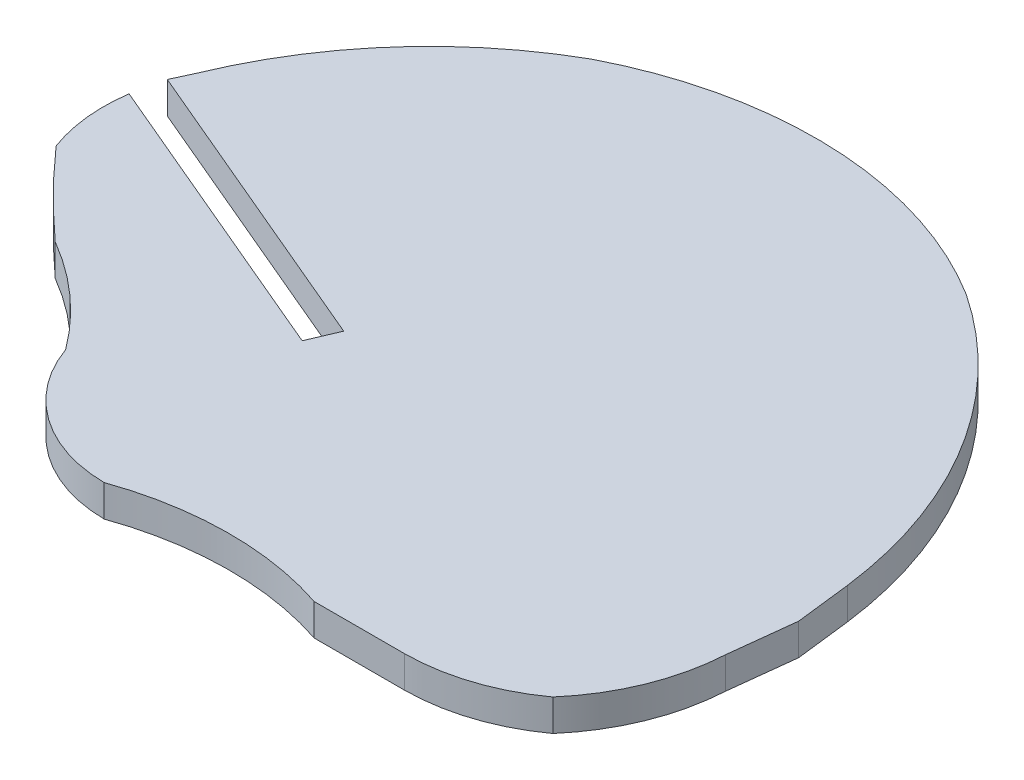
ISO-10303-21;
HEADER;
FILE_DESCRIPTION(('STEP AP214'),'2;1');
FILE_NAME('part.step','',(''),(''),'','','');
FILE_SCHEMA(('AUTOMOTIVE_DESIGN { 1 0 10303 214 1 1 1 1 }'));
ENDSEC;
DATA;
#1=APPLICATION_CONTEXT('core data for automotive mechanical design processes');
#2=APPLICATION_PROTOCOL_DEFINITION('international standard','automotive_design',2000,#1);
#3=PRODUCT_CONTEXT('',#1,'mechanical');
#4=PRODUCT('Part','Part','',(#3));
#5=PRODUCT_RELATED_PRODUCT_CATEGORY('part','',(#4));
#6=PRODUCT_DEFINITION_FORMATION('','',#4);
#7=PRODUCT_DEFINITION_CONTEXT('part definition',#1,'design');
#8=PRODUCT_DEFINITION('design','',#6,#7);
#9=PRODUCT_DEFINITION_SHAPE('','',#8);
#10=(LENGTH_UNIT() NAMED_UNIT(*) SI_UNIT(.MILLI.,.METRE.));
#11=(NAMED_UNIT(*) PLANE_ANGLE_UNIT() SI_UNIT($,.RADIAN.));
#12=(NAMED_UNIT(*) SI_UNIT($,.STERADIAN.) SOLID_ANGLE_UNIT());
#13=UNCERTAINTY_MEASURE_WITH_UNIT(LENGTH_MEASURE(1.E-05),#10,'distance_accuracy_value','');
#14=(GEOMETRIC_REPRESENTATION_CONTEXT(3) GLOBAL_UNCERTAINTY_ASSIGNED_CONTEXT((#13)) GLOBAL_UNIT_ASSIGNED_CONTEXT((#10,
#11,#12)) REPRESENTATION_CONTEXT('',''));
#15=CARTESIAN_POINT('',(0.,0.,0.));
#16=DIRECTION('',(0.,0.,1.));
#17=DIRECTION('',(1.,0.,0.));
#18=AXIS2_PLACEMENT_3D('',#15,#16,#17);
#19=CARTESIAN_POINT('',(-201.178824260618,2.,-595.816390173539));
#20=DIRECTION('',(0.,-1.,0.));
#21=DIRECTION('',(0.,0.,-1.));
#22=AXIS2_PLACEMENT_3D('',#19,#20,#21);
#23=CYLINDRICAL_SURFACE('',#22,25.04878585);
#24=CARTESIAN_POINT('',(-201.178824260618,0.,-595.816390173539));
#25=DIRECTION('',(0.,1.,0.));
#26=DIRECTION('',(0.,0.,1.));
#27=AXIS2_PLACEMENT_3D('',#24,#25,#26);
#28=CIRCLE('',#27,25.04878585);
#29=CARTESIAN_POINT('',(-187.918530000009,0.,-617.067419999908));
#30=VERTEX_POINT('',#29);
#31=CARTESIAN_POINT('',(-212.66633999995,0.,-618.075740000022));
#32=VERTEX_POINT('',#31);
#33=EDGE_CURVE('E11',#30,#32,#28,.T.);
#34=ORIENTED_EDGE('',*,*,#33,.T.);
#35=DIRECTION('',(0.,-1.,0.));
#36=VECTOR('',#35,1.);
#37=CARTESIAN_POINT('',(-212.66633999995,2.,-618.075740000022));
#38=LINE('',#37,#36);
#39=CARTESIAN_POINT('',(-212.66633999995,2.,-618.075740000022));
#40=VERTEX_POINT('',#39);
#41=EDGE_CURVE('E342',#40,#32,#38,.T.);
#42=ORIENTED_EDGE('',*,*,#41,.F.);
#43=CARTESIAN_POINT('',(-201.178824260618,2.,-595.816390173539));
#44=DIRECTION('',(0.,1.,0.));
#45=DIRECTION('',(0.,0.,1.));
#46=AXIS2_PLACEMENT_3D('',#43,#44,#45);
#47=CIRCLE('',#46,25.04878585);
#48=CARTESIAN_POINT('',(-187.918530000009,2.,-617.067419999908));
#49=VERTEX_POINT('',#48);
#50=EDGE_CURVE('E41',#49,#40,#47,.T.);
#51=ORIENTED_EDGE('',*,*,#50,.F.);
#52=DIRECTION('',(0.,-1.,0.));
#53=VECTOR('',#52,1.);
#54=CARTESIAN_POINT('',(-187.918530000009,2.,-617.067419999908));
#55=LINE('',#54,#53);
#56=EDGE_CURVE('E195',#49,#30,#55,.T.);
#57=ORIENTED_EDGE('',*,*,#56,.T.);
#58=EDGE_LOOP('',(#34,#42,#51,#57));
#59=FACE_BOUND('',#58,.T.);
#60=ADVANCED_FACE('F37',(#59),#23,.T.);
#61=CARTESIAN_POINT('',(-199.322342821807,2.,-594.556136802383));
#62=DIRECTION('',(0.,-1.,0.));
#63=DIRECTION('',(0.,0.,-1.));
#64=AXIS2_PLACEMENT_3D('',#61,#62,#63);
#65=CYLINDRICAL_SURFACE('',#64,27.0413386367001);
#66=CARTESIAN_POINT('',(-199.322342821807,0.,-594.556136802383));
#67=DIRECTION('',(0.,1.,0.));
#68=DIRECTION('',(0.,0.,1.));
#69=AXIS2_PLACEMENT_3D('',#66,#67,#68);
#70=CIRCLE('',#69,27.0413386367001);
#71=CARTESIAN_POINT('',(-224.319209999995,0.,-604.870720000006));
#72=VERTEX_POINT('',#71);
#73=EDGE_CURVE('E47',#32,#72,#70,.T.);
#74=ORIENTED_EDGE('',*,*,#73,.T.);
#75=DIRECTION('',(0.,-1.,0.));
#76=VECTOR('',#75,1.);
#77=CARTESIAN_POINT('',(-224.319209999995,2.,-604.870720000006));
#78=LINE('',#77,#76);
#79=CARTESIAN_POINT('',(-224.319209999995,2.,-604.870720000006));
#80=VERTEX_POINT('',#79);
#81=EDGE_CURVE('E171',#80,#72,#78,.T.);
#82=ORIENTED_EDGE('',*,*,#81,.F.);
#83=CARTESIAN_POINT('',(-199.322342821807,2.,-594.556136802383));
#84=DIRECTION('',(0.,1.,0.));
#85=DIRECTION('',(0.,0.,1.));
#86=AXIS2_PLACEMENT_3D('',#83,#84,#85);
#87=CIRCLE('',#86,27.0413386367001);
#88=EDGE_CURVE('E110',#40,#80,#87,.T.);
#89=ORIENTED_EDGE('',*,*,#88,.F.);
#90=ORIENTED_EDGE('',*,*,#41,.T.);
#91=EDGE_LOOP('',(#74,#82,#89,#90));
#92=FACE_BOUND('',#91,.T.);
#93=ADVANCED_FACE('F343',(#92),#65,.T.);
#94=CARTESIAN_POINT('',(-289.527334703317,2.,-463.291078429003));
#95=DIRECTION('',(0.908291866319763,0.,0.418337047818337));
#96=DIRECTION('',(0.418337047818337,0.,-0.908291866319763));
#97=AXIS2_PLACEMENT_3D('',#94,#95,#96);
#98=PLANE('',#97);
#99=DIRECTION('',(-0.418337047818337,0.,0.908291866319763));
#100=VECTOR('',#99,1.);
#101=CARTESIAN_POINT('',(-289.527334703317,0.,-463.291078429003));
#102=LINE('',#101,#100);
#103=CARTESIAN_POINT('',(-224.91344,0.,-603.58053));
#104=VERTEX_POINT('',#103);
#105=EDGE_CURVE('E165',#72,#104,#102,.T.);
#106=ORIENTED_EDGE('',*,*,#105,.T.);
#107=DIRECTION('',(0.,-1.,0.));
#108=VECTOR('',#107,1.);
#109=CARTESIAN_POINT('',(-224.91344,2.,-603.58053));
#110=LINE('',#109,#108);
#111=CARTESIAN_POINT('',(-224.91344,2.,-603.58053));
#112=VERTEX_POINT('',#111);
#113=EDGE_CURVE('E169',#112,#104,#110,.T.);
#114=ORIENTED_EDGE('',*,*,#113,.F.);
#115=DIRECTION('',(-0.418337047818337,0.,0.908291866319763));
#116=VECTOR('',#115,1.);
#117=CARTESIAN_POINT('',(-289.527334703317,2.,-463.291078429003));
#118=LINE('',#117,#116);
#119=EDGE_CURVE('E222',#80,#112,#118,.T.);
#120=ORIENTED_EDGE('',*,*,#119,.F.);
#121=ORIENTED_EDGE('',*,*,#81,.T.);
#122=EDGE_LOOP('',(#106,#114,#120,#121));
#123=FACE_BOUND('',#122,.T.);
#124=ADVANCED_FACE('F167',(#123),#98,.F.);
#125=CARTESIAN_POINT('',(-468.755826670752,2.,-706.916494491902));
#126=DIRECTION('',(0.390190390776438,0.,-0.920734195599213));
#127=DIRECTION('',(-0.920734195599213,0.,-0.390190390776438));
#128=AXIS2_PLACEMENT_3D('',#125,#126,#127);
#129=PLANE('',#128);
#130=DIRECTION('',(0.920734195599213,0.,0.390190390776438));
#131=VECTOR('',#130,1.);
#132=CARTESIAN_POINT('',(-468.755826670752,0.,-706.916494491902));
#133=LINE('',#132,#131);
#134=CARTESIAN_POINT('',(-205.5657,0.,-595.38131));
#135=VERTEX_POINT('',#134);
#136=EDGE_CURVE('E173',#104,#135,#133,.T.);
#137=ORIENTED_EDGE('',*,*,#136,.T.);
#138=DIRECTION('',(0.,-1.,0.));
#139=VECTOR('',#138,1.);
#140=CARTESIAN_POINT('',(-205.5657,2.,-595.38131));
#141=LINE('',#140,#139);
#142=CARTESIAN_POINT('',(-205.5657,2.,-595.38131));
#143=VERTEX_POINT('',#142);
#144=EDGE_CURVE('E180',#143,#135,#141,.T.);
#145=ORIENTED_EDGE('',*,*,#144,.F.);
#146=DIRECTION('',(0.920734195599213,0.,0.390190390776438));
#147=VECTOR('',#146,1.);
#148=CARTESIAN_POINT('',(-468.755826670752,2.,-706.916494491902));
#149=LINE('',#148,#147);
#150=EDGE_CURVE('E179',#112,#143,#149,.T.);
#151=ORIENTED_EDGE('',*,*,#150,.F.);
#152=ORIENTED_EDGE('',*,*,#113,.T.);
#153=EDGE_LOOP('',(#137,#145,#151,#152));
#154=FACE_BOUND('',#153,.T.);
#155=ADVANCED_FACE('F176',(#154),#129,.F.);
#156=CARTESIAN_POINT('',(-263.889536272211,2.,-459.607107482068));
#157=DIRECTION('',(0.918814193131808,0.,0.39469035774838));
#158=DIRECTION('',(0.39469035774838,0.,-0.918814193131808));
#159=AXIS2_PLACEMENT_3D('',#156,#157,#158);
#160=PLANE('',#159);
#161=DIRECTION('',(-0.39469035774838,0.,0.918814193131809));
#162=VECTOR('',#161,1.);
#163=CARTESIAN_POINT('',(-263.889536272211,0.,-459.607107482068));
#164=LINE('',#163,#162);
#165=CARTESIAN_POINT('',(-206.35509,0.,-593.54366));
#166=VERTEX_POINT('',#165);
#167=EDGE_CURVE('E185',#135,#166,#164,.T.);
#168=ORIENTED_EDGE('',*,*,#167,.T.);
#169=DIRECTION('',(0.,-1.,0.));
#170=VECTOR('',#169,1.);
#171=CARTESIAN_POINT('',(-206.35509,2.,-593.54366));
#172=LINE('',#171,#170);
#173=CARTESIAN_POINT('',(-206.35509,2.,-593.54366));
#174=VERTEX_POINT('',#173);
#175=EDGE_CURVE('E261',#174,#166,#172,.T.);
#176=ORIENTED_EDGE('',*,*,#175,.F.);
#177=DIRECTION('',(-0.39469035774838,0.,0.918814193131809));
#178=VECTOR('',#177,1.);
#179=CARTESIAN_POINT('',(-263.889536272211,2.,-459.607107482068));
#180=LINE('',#179,#178);
#181=EDGE_CURVE('E219',#143,#174,#180,.T.);
#182=ORIENTED_EDGE('',*,*,#181,.F.);
#183=ORIENTED_EDGE('',*,*,#144,.T.);
#184=EDGE_LOOP('',(#168,#176,#182,#183));
#185=FACE_BOUND('',#184,.T.);
#186=ADVANCED_FACE('F338',(#185),#160,.F.);
#187=CARTESIAN_POINT('',(-469.536257299438,2.,-705.074984167133));
#188=DIRECTION('',(-0.390190202426747,0.,0.920734275418361));
#189=DIRECTION('',(0.920734275418361,0.,0.390190202426747));
#190=AXIS2_PLACEMENT_3D('',#187,#188,#189);
#191=PLANE('',#190);
#192=DIRECTION('',(-0.920734275418361,0.,-0.390190202426747));
#193=VECTOR('',#192,1.);
#194=CARTESIAN_POINT('',(-469.536257299438,0.,-705.074984167133));
#195=LINE('',#194,#193);
#196=CARTESIAN_POINT('',(-225.33501,0.,-601.587));
#197=VERTEX_POINT('',#196);
#198=EDGE_CURVE('E187',#166,#197,#195,.T.);
#199=ORIENTED_EDGE('',*,*,#198,.T.);
#200=DIRECTION('',(0.,-1.,0.));
#201=VECTOR('',#200,1.);
#202=CARTESIAN_POINT('',(-225.33501,2.,-601.587));
#203=LINE('',#202,#201);
#204=CARTESIAN_POINT('',(-225.33501,2.,-601.587));
#205=VERTEX_POINT('',#204);
#206=EDGE_CURVE('E258',#205,#197,#203,.T.);
#207=ORIENTED_EDGE('',*,*,#206,.F.);
#208=DIRECTION('',(-0.920734275418361,0.,-0.390190202426747));
#209=VECTOR('',#208,1.);
#210=CARTESIAN_POINT('',(-469.536257299438,2.,-705.074984167133));
#211=LINE('',#210,#209);
#212=EDGE_CURVE('E217',#174,#205,#211,.T.);
#213=ORIENTED_EDGE('',*,*,#212,.F.);
#214=ORIENTED_EDGE('',*,*,#175,.T.);
#215=EDGE_LOOP('',(#199,#207,#213,#214));
#216=FACE_BOUND('',#215,.T.);
#217=ADVANCED_FACE('F256',(#216),#191,.F.);
#218=CARTESIAN_POINT('',(-214.952729075906,2.,-600.075931240016));
#219=DIRECTION('',(0.,-1.,0.));
#220=DIRECTION('',(0.,0.,-1.));
#221=AXIS2_PLACEMENT_3D('',#218,#219,#220);
#222=CYLINDRICAL_SURFACE('',#221,10.4916674549);
#223=CARTESIAN_POINT('',(-214.952729075906,0.,-600.075931240016));
#224=DIRECTION('',(0.,1.,0.));
#225=DIRECTION('',(0.,0.,1.));
#226=AXIS2_PLACEMENT_3D('',#223,#224,#225);
#227=CIRCLE('',#226,10.4916674549);
#228=CARTESIAN_POINT('',(-224.791219999985,0.,-596.431869999995));
#229=VERTEX_POINT('',#228);
#230=EDGE_CURVE('E251',#197,#229,#227,.T.);
#231=ORIENTED_EDGE('',*,*,#230,.T.);
#232=DIRECTION('',(0.,-1.,0.));
#233=VECTOR('',#232,1.);
#234=CARTESIAN_POINT('',(-224.791219999985,2.,-596.431869999995));
#235=LINE('',#234,#233);
#236=CARTESIAN_POINT('',(-224.791219999985,2.,-596.431869999995));
#237=VERTEX_POINT('',#236);
#238=EDGE_CURVE('E267',#237,#229,#235,.T.);
#239=ORIENTED_EDGE('',*,*,#238,.F.);
#240=CARTESIAN_POINT('',(-214.952729075906,2.,-600.075931240016));
#241=DIRECTION('',(0.,1.,0.));
#242=DIRECTION('',(0.,0.,1.));
#243=AXIS2_PLACEMENT_3D('',#240,#241,#242);
#244=CIRCLE('',#243,10.4916674549);
#245=EDGE_CURVE('E215',#205,#237,#244,.T.);
#246=ORIENTED_EDGE('',*,*,#245,.F.);
#247=ORIENTED_EDGE('',*,*,#206,.T.);
#248=EDGE_LOOP('',(#231,#239,#246,#247));
#249=FACE_BOUND('',#248,.T.);
#250=ADVANCED_FACE('F264',(#249),#222,.T.);
#251=CARTESIAN_POINT('',(-176.169173259683,2.,-639.315303830639));
#252=DIRECTION('',(0.,-1.,0.));
#253=DIRECTION('',(0.,0.,-1.));
#254=AXIS2_PLACEMENT_3D('',#251,#252,#253);
#255=CYLINDRICAL_SURFACE('',#254,64.8312604098);
#256=CARTESIAN_POINT('',(-176.169173259683,0.,-639.315303830639));
#257=DIRECTION('',(0.,1.,0.));
#258=DIRECTION('',(0.,0.,1.));
#259=AXIS2_PLACEMENT_3D('',#256,#257,#258);
#260=CIRCLE('',#259,64.8312604098);
#261=CARTESIAN_POINT('',(-219.568640000066,0.,-591.153300000091));
#262=VERTEX_POINT('',#261);
#263=EDGE_CURVE('E248',#229,#262,#260,.T.);
#264=ORIENTED_EDGE('',*,*,#263,.T.);
#265=DIRECTION('',(0.,-1.,0.));
#266=VECTOR('',#265,1.);
#267=CARTESIAN_POINT('',(-219.568640000066,2.,-591.153300000091));
#268=LINE('',#267,#266);
#269=CARTESIAN_POINT('',(-219.568640000066,2.,-591.153300000091));
#270=VERTEX_POINT('',#269);
#271=EDGE_CURVE('E276',#270,#262,#268,.T.);
#272=ORIENTED_EDGE('',*,*,#271,.F.);
#273=CARTESIAN_POINT('',(-176.169173259683,2.,-639.315303830639));
#274=DIRECTION('',(0.,1.,0.));
#275=DIRECTION('',(0.,0.,1.));
#276=AXIS2_PLACEMENT_3D('',#273,#274,#275);
#277=CIRCLE('',#276,64.8312604098);
#278=EDGE_CURVE('E213',#237,#270,#277,.T.);
#279=ORIENTED_EDGE('',*,*,#278,.F.);
#280=ORIENTED_EDGE('',*,*,#238,.T.);
#281=EDGE_LOOP('',(#264,#272,#279,#280));
#282=FACE_BOUND('',#281,.T.);
#283=ADVANCED_FACE('F274',(#282),#255,.T.);
#284=CARTESIAN_POINT('',(-229.974823367423,2.,-573.25173301262));
#285=DIRECTION('',(0.,-1.,0.));
#286=DIRECTION('',(0.,0.,-1.));
#287=AXIS2_PLACEMENT_3D('',#284,#285,#286);
#288=CYLINDRICAL_SURFACE('',#287,20.7063940096276);
#289=CARTESIAN_POINT('',(-229.974823367423,0.,-573.25173301262));
#290=DIRECTION('',(0.,1.,0.));
#291=DIRECTION('',(0.,0.,1.));
#292=AXIS2_PLACEMENT_3D('',#289,#290,#291);
#293=CIRCLE('',#292,20.7063940096276);
#294=CARTESIAN_POINT('',(-213.337230000003,0.,-585.578340000041));
#295=VERTEX_POINT('',#294);
#296=EDGE_CURVE('E245',#295,#262,#293,.T.);
#297=ORIENTED_EDGE('',*,*,#296,.F.);
#298=DIRECTION('',(0.,-1.,0.));
#299=VECTOR('',#298,1.);
#300=CARTESIAN_POINT('',(-213.337230000003,2.,-585.578340000041));
#301=LINE('',#300,#299);
#302=CARTESIAN_POINT('',(-213.337230000003,2.,-585.578340000041));
#303=VERTEX_POINT('',#302);
#304=EDGE_CURVE('E278',#303,#295,#301,.T.);
#305=ORIENTED_EDGE('',*,*,#304,.F.);
#306=CARTESIAN_POINT('',(-229.974823367423,2.,-573.25173301262));
#307=DIRECTION('',(0.,1.,0.));
#308=DIRECTION('',(0.,0.,1.));
#309=AXIS2_PLACEMENT_3D('',#306,#307,#308);
#310=CIRCLE('',#309,20.7063940096276);
#311=EDGE_CURVE('E210',#303,#270,#310,.T.);
#312=ORIENTED_EDGE('',*,*,#311,.T.);
#313=ORIENTED_EDGE('',*,*,#271,.T.);
#314=EDGE_LOOP('',(#297,#305,#312,#313));
#315=FACE_BOUND('',#314,.T.);
#316=ADVANCED_FACE('F333',(#315),#288,.F.);
#317=CARTESIAN_POINT('',(-204.76990443646,2.,-588.619473162437));
#318=DIRECTION('',(0.,-1.,0.));
#319=DIRECTION('',(0.,0.,-1.));
#320=AXIS2_PLACEMENT_3D('',#317,#318,#319);
#321=CYLINDRICAL_SURFACE('',#320,9.09107024629999);
#322=CARTESIAN_POINT('',(-204.76990443646,0.,-588.619473162437));
#323=DIRECTION('',(0.,1.,0.));
#324=DIRECTION('',(0.,0.,1.));
#325=AXIS2_PLACEMENT_3D('',#322,#323,#324);
#326=CIRCLE('',#325,9.09107024629999);
#327=CARTESIAN_POINT('',(-204.850480000019,0.,-579.528759999999));
#328=VERTEX_POINT('',#327);
#329=EDGE_CURVE('E242',#295,#328,#326,.T.);
#330=ORIENTED_EDGE('',*,*,#329,.T.);
#331=DIRECTION('',(0.,-1.,0.));
#332=VECTOR('',#331,1.);
#333=CARTESIAN_POINT('',(-204.850480000019,2.,-579.528759999999));
#334=LINE('',#333,#332);
#335=CARTESIAN_POINT('',(-204.850480000019,2.,-579.528759999999));
#336=VERTEX_POINT('',#335);
#337=EDGE_CURVE('E283',#336,#328,#334,.T.);
#338=ORIENTED_EDGE('',*,*,#337,.F.);
#339=CARTESIAN_POINT('',(-204.76990443646,2.,-588.619473162437));
#340=DIRECTION('',(0.,1.,0.));
#341=DIRECTION('',(0.,0.,1.));
#342=AXIS2_PLACEMENT_3D('',#339,#340,#341);
#343=CIRCLE('',#342,9.09107024629999);
#344=EDGE_CURVE('E208',#303,#336,#343,.T.);
#345=ORIENTED_EDGE('',*,*,#344,.F.);
#346=ORIENTED_EDGE('',*,*,#304,.T.);
#347=EDGE_LOOP('',(#330,#338,#345,#346));
#348=FACE_BOUND('',#347,.T.);
#349=ADVANCED_FACE('F365',(#348),#321,.T.);
#350=CARTESIAN_POINT('',(-198.093698539091,2.,-560.42554991861));
#351=DIRECTION('',(0.,-1.,0.));
#352=DIRECTION('',(0.,0.,-1.));
#353=AXIS2_PLACEMENT_3D('',#350,#351,#352);
#354=CYLINDRICAL_SURFACE('',#353,20.2629398440709);
#355=CARTESIAN_POINT('',(-198.093698539091,0.,-560.42554991861));
#356=DIRECTION('',(0.,1.,0.));
#357=DIRECTION('',(0.,0.,1.));
#358=AXIS2_PLACEMENT_3D('',#355,#356,#357);
#359=CIRCLE('',#358,20.2629398440709);
#360=CARTESIAN_POINT('',(-191.702360000037,0.,-579.65411));
#361=VERTEX_POINT('',#360);
#362=EDGE_CURVE('E239',#361,#328,#359,.T.);
#363=ORIENTED_EDGE('',*,*,#362,.F.);
#364=DIRECTION('',(0.,-1.,0.));
#365=VECTOR('',#364,1.);
#366=CARTESIAN_POINT('',(-191.702360000037,2.,-579.65411));
#367=LINE('',#366,#365);
#368=CARTESIAN_POINT('',(-191.702360000037,2.,-579.65411));
#369=VERTEX_POINT('',#368);
#370=EDGE_CURVE('E285',#369,#361,#367,.T.);
#371=ORIENTED_EDGE('',*,*,#370,.F.);
#372=CARTESIAN_POINT('',(-198.093698539091,2.,-560.42554991861));
#373=DIRECTION('',(0.,1.,0.));
#374=DIRECTION('',(0.,0.,1.));
#375=AXIS2_PLACEMENT_3D('',#372,#373,#374);
#376=CIRCLE('',#375,20.2629398440709);
#377=EDGE_CURVE('E205',#369,#336,#376,.T.);
#378=ORIENTED_EDGE('',*,*,#377,.T.);
#379=ORIENTED_EDGE('',*,*,#337,.T.);
#380=EDGE_LOOP('',(#363,#371,#378,#379));
#381=FACE_BOUND('',#380,.T.);
#382=ADVANCED_FACE('F329',(#381),#354,.F.);
#383=CARTESIAN_POINT('',(-525.869702128861,2.,-579.65411));
#384=DIRECTION('',(0.,0.,-1.));
#385=DIRECTION('',(-1.,0.,0.));
#386=AXIS2_PLACEMENT_3D('',#383,#384,#385);
#387=PLANE('',#386);
#388=DIRECTION('',(1.,0.,0.));
#389=VECTOR('',#388,1.);
#390=CARTESIAN_POINT('',(-525.869702128861,0.,-579.65411));
#391=LINE('',#390,#389);
#392=CARTESIAN_POINT('',(-186.00501,0.,-579.65411));
#393=VERTEX_POINT('',#392);
#394=EDGE_CURVE('E237',#361,#393,#391,.T.);
#395=ORIENTED_EDGE('',*,*,#394,.T.);
#396=DIRECTION('',(0.,-1.,0.));
#397=VECTOR('',#396,1.);
#398=CARTESIAN_POINT('',(-186.00501,2.,-579.65411));
#399=LINE('',#398,#397);
#400=CARTESIAN_POINT('',(-186.00501,2.,-579.65411));
#401=VERTEX_POINT('',#400);
#402=EDGE_CURVE('E287',#401,#393,#399,.T.);
#403=ORIENTED_EDGE('',*,*,#402,.F.);
#404=DIRECTION('',(1.,0.,0.));
#405=VECTOR('',#404,1.);
#406=CARTESIAN_POINT('',(-525.869702128861,2.,-579.65411));
#407=LINE('',#406,#405);
#408=EDGE_CURVE('E203',#369,#401,#407,.T.);
#409=ORIENTED_EDGE('',*,*,#408,.F.);
#410=ORIENTED_EDGE('',*,*,#370,.T.);
#411=EDGE_LOOP('',(#395,#403,#409,#410));
#412=FACE_BOUND('',#411,.T.);
#413=ADVANCED_FACE('F326',(#412),#387,.F.);
#414=CARTESIAN_POINT('',(-186.057527829218,2.,-591.752933986059));
#415=DIRECTION('',(0.,-1.,0.));
#416=DIRECTION('',(0.,0.,-1.));
#417=AXIS2_PLACEMENT_3D('',#414,#415,#416);
#418=CYLINDRICAL_SURFACE('',#417,12.0989379685999);
#419=CARTESIAN_POINT('',(-186.057527829218,0.,-591.752933986059));
#420=DIRECTION('',(0.,1.,0.));
#421=DIRECTION('',(0.,0.,1.));
#422=AXIS2_PLACEMENT_3D('',#419,#420,#421);
#423=CIRCLE('',#422,12.0989379685999);
#424=CARTESIAN_POINT('',(-178.942590000027,0.,-581.967129999939));
#425=VERTEX_POINT('',#424);
#426=EDGE_CURVE('E235',#393,#425,#423,.T.);
#427=ORIENTED_EDGE('',*,*,#426,.T.);
#428=DIRECTION('',(0.,-1.,0.));
#429=VECTOR('',#428,1.);
#430=CARTESIAN_POINT('',(-178.942590000027,2.,-581.967129999939));
#431=LINE('',#430,#429);
#432=CARTESIAN_POINT('',(-178.942590000027,2.,-581.967129999939));
#433=VERTEX_POINT('',#432);
#434=EDGE_CURVE('E290',#433,#425,#431,.T.);
#435=ORIENTED_EDGE('',*,*,#434,.F.);
#436=CARTESIAN_POINT('',(-186.057527829218,2.,-591.752933986059));
#437=DIRECTION('',(0.,1.,0.));
#438=DIRECTION('',(0.,0.,1.));
#439=AXIS2_PLACEMENT_3D('',#436,#437,#438);
#440=CIRCLE('',#439,12.0989379685999);
#441=EDGE_CURVE('E201',#401,#433,#440,.T.);
#442=ORIENTED_EDGE('',*,*,#441,.F.);
#443=ORIENTED_EDGE('',*,*,#402,.T.);
#444=EDGE_LOOP('',(#427,#435,#442,#443));
#445=FACE_BOUND('',#444,.T.);
#446=ADVANCED_FACE('F321',(#445),#418,.T.);
#447=CARTESIAN_POINT('',(-188.771550351297,2.,-590.46808913225));
#448=DIRECTION('',(0.,-1.,0.));
#449=DIRECTION('',(0.,0.,-1.));
#450=AXIS2_PLACEMENT_3D('',#447,#448,#449);
#451=CYLINDRICAL_SURFACE('',#450,12.9951824826);
#452=CARTESIAN_POINT('',(-188.771550351297,0.,-590.46808913225));
#453=DIRECTION('',(0.,1.,0.));
#454=DIRECTION('',(0.,0.,1.));
#455=AXIS2_PLACEMENT_3D('',#452,#453,#454);
#456=CIRCLE('',#455,12.9951824826);
#457=CARTESIAN_POINT('',(-175.796969999936,0.,-589.736630000005));
#458=VERTEX_POINT('',#457);
#459=EDGE_CURVE('E233',#425,#458,#456,.T.);
#460=ORIENTED_EDGE('',*,*,#459,.T.);
#461=DIRECTION('',(0.,-1.,0.));
#462=VECTOR('',#461,1.);
#463=CARTESIAN_POINT('',(-175.796969999936,2.,-589.736630000005));
#464=LINE('',#463,#462);
#465=CARTESIAN_POINT('',(-175.796969999936,2.,-589.736630000005));
#466=VERTEX_POINT('',#465);
#467=EDGE_CURVE('E293',#466,#458,#464,.T.);
#468=ORIENTED_EDGE('',*,*,#467,.F.);
#469=CARTESIAN_POINT('',(-188.771550351297,2.,-590.46808913225));
#470=DIRECTION('',(0.,1.,0.));
#471=DIRECTION('',(0.,0.,1.));
#472=AXIS2_PLACEMENT_3D('',#469,#470,#471);
#473=CIRCLE('',#472,12.9951824826);
#474=EDGE_CURVE('E199',#433,#466,#473,.T.);
#475=ORIENTED_EDGE('',*,*,#474,.F.);
#476=ORIENTED_EDGE('',*,*,#434,.T.);
#477=EDGE_LOOP('',(#460,#468,#475,#476));
#478=FACE_BOUND('',#477,.T.);
#479=ADVANCED_FACE('F315',(#478),#451,.T.);
#480=CARTESIAN_POINT('',(-182.302558112941,2.,-532.852402223798));
#481=DIRECTION('',(-0.993523736995855,0.,-0.113624750938301));
#482=DIRECTION('',(-0.113624750938301,0.,0.993523736995855));
#483=AXIS2_PLACEMENT_3D('',#480,#481,#482);
#484=PLANE('',#483);
#485=DIRECTION('',(0.113624750938301,0.,-0.993523736995855));
#486=VECTOR('',#485,1.);
#487=CARTESIAN_POINT('',(-182.302558112941,0.,-532.852402223798));
#488=LINE('',#487,#486);
#489=CARTESIAN_POINT('',(-175.32219,0.,-593.88806));
#490=VERTEX_POINT('',#489);
#491=EDGE_CURVE('E227',#458,#490,#488,.T.);
#492=ORIENTED_EDGE('',*,*,#491,.T.);
#493=DIRECTION('',(0.,-1.,0.));
#494=VECTOR('',#493,1.);
#495=CARTESIAN_POINT('',(-175.32219,2.,-593.88806));
#496=LINE('',#495,#494);
#497=CARTESIAN_POINT('',(-175.32219,2.,-593.88806));
#498=VERTEX_POINT('',#497);
#499=EDGE_CURVE('E296',#498,#490,#496,.T.);
#500=ORIENTED_EDGE('',*,*,#499,.F.);
#501=DIRECTION('',(0.113624750938301,0.,-0.993523736995855));
#502=VECTOR('',#501,1.);
#503=CARTESIAN_POINT('',(-182.302558112941,2.,-532.852402223798));
#504=LINE('',#503,#502);
#505=EDGE_CURVE('E197',#466,#498,#504,.T.);
#506=ORIENTED_EDGE('',*,*,#505,.F.);
#507=ORIENTED_EDGE('',*,*,#467,.T.);
#508=EDGE_LOOP('',(#492,#500,#506,#507));
#509=FACE_BOUND('',#508,.T.);
#510=ADVANCED_FACE('F311',(#509),#484,.F.);
#511=CARTESIAN_POINT('',(-177.649990817657,2.,-613.492232643032));
#512=DIRECTION('',(-0.993024078119403,0.,0.117911747824845));
#513=DIRECTION('',(0.117911747824845,0.,0.993024078119403));
#514=AXIS2_PLACEMENT_3D('',#511,#512,#513);
#515=PLANE('',#514);
#516=DIRECTION('',(-0.117911747824844,0.,-0.993024078119403));
#517=VECTOR('',#516,1.);
#518=CARTESIAN_POINT('',(-177.649990817657,0.,-613.492232643032));
#519=LINE('',#518,#517);
#520=CARTESIAN_POINT('',(-175.73769,0.,-597.3873));
#521=VERTEX_POINT('',#520);
#522=EDGE_CURVE('E225',#490,#521,#519,.T.);
#523=ORIENTED_EDGE('',*,*,#522,.T.);
#524=DIRECTION('',(0.,-1.,0.));
#525=VECTOR('',#524,1.);
#526=CARTESIAN_POINT('',(-175.73769,2.,-597.3873));
#527=LINE('',#526,#525);
#528=CARTESIAN_POINT('',(-175.73769,2.,-597.3873));
#529=VERTEX_POINT('',#528);
#530=EDGE_CURVE('E298',#529,#521,#527,.T.);
#531=ORIENTED_EDGE('',*,*,#530,.F.);
#532=DIRECTION('',(-0.117911747824844,0.,-0.993024078119403));
#533=VECTOR('',#532,1.);
#534=CARTESIAN_POINT('',(-177.649990817657,2.,-613.492232643032));
#535=LINE('',#534,#533);
#536=EDGE_CURVE('E194',#498,#529,#535,.T.);
#537=ORIENTED_EDGE('',*,*,#536,.F.);
#538=ORIENTED_EDGE('',*,*,#499,.T.);
#539=EDGE_LOOP('',(#523,#531,#537,#538));
#540=FACE_BOUND('',#539,.T.);
#541=ADVANCED_FACE('F306',(#540),#515,.F.);
#542=CARTESIAN_POINT('',(-203.418084932942,2.,-593.864431813361));
#543=DIRECTION('',(0.,-1.,0.));
#544=DIRECTION('',(0.,0.,-1.));
#545=AXIS2_PLACEMENT_3D('',#542,#543,#544);
#546=CYLINDRICAL_SURFACE('',#545,27.9036711546);
#547=CARTESIAN_POINT('',(-203.418084932942,0.,-593.864431813361));
#548=DIRECTION('',(0.,1.,0.));
#549=DIRECTION('',(0.,0.,1.));
#550=AXIS2_PLACEMENT_3D('',#547,#548,#549);
#551=CIRCLE('',#550,27.9036711546);
#552=EDGE_CURVE('E121',#521,#30,#551,.T.);
#553=ORIENTED_EDGE('',*,*,#552,.T.);
#554=ORIENTED_EDGE('',*,*,#56,.F.);
#555=CARTESIAN_POINT('',(-203.418084932942,2.,-593.864431813361));
#556=DIRECTION('',(0.,1.,0.));
#557=DIRECTION('',(0.,0.,1.));
#558=AXIS2_PLACEMENT_3D('',#555,#556,#557);
#559=CIRCLE('',#558,27.9036711546);
#560=EDGE_CURVE('E192',#529,#49,#559,.T.);
#561=ORIENTED_EDGE('',*,*,#560,.F.);
#562=ORIENTED_EDGE('',*,*,#530,.T.);
#563=EDGE_LOOP('',(#553,#554,#561,#562));
#564=FACE_BOUND('',#563,.T.);
#565=ADVANCED_FACE('F380',(#564),#546,.T.);
#566=CARTESIAN_POINT('',(-525.869702128861,2.,-572.1446));
#567=DIRECTION('',(0.,1.,0.));
#568=DIRECTION('',(0.,0.,1.));
#569=AXIS2_PLACEMENT_3D('',#566,#567,#568);
#570=PLANE('',#569);
#571=ORIENTED_EDGE('',*,*,#50,.T.);
#572=ORIENTED_EDGE('',*,*,#88,.T.);
#573=ORIENTED_EDGE('',*,*,#119,.T.);
#574=ORIENTED_EDGE('',*,*,#150,.T.);
#575=ORIENTED_EDGE('',*,*,#181,.T.);
#576=ORIENTED_EDGE('',*,*,#212,.T.);
#577=ORIENTED_EDGE('',*,*,#245,.T.);
#578=ORIENTED_EDGE('',*,*,#278,.T.);
#579=ORIENTED_EDGE('',*,*,#311,.F.);
#580=ORIENTED_EDGE('',*,*,#344,.T.);
#581=ORIENTED_EDGE('',*,*,#377,.F.);
#582=ORIENTED_EDGE('',*,*,#408,.T.);
#583=ORIENTED_EDGE('',*,*,#441,.T.);
#584=ORIENTED_EDGE('',*,*,#474,.T.);
#585=ORIENTED_EDGE('',*,*,#505,.T.);
#586=ORIENTED_EDGE('',*,*,#536,.T.);
#587=ORIENTED_EDGE('',*,*,#560,.T.);
#588=EDGE_LOOP('',(#571,#572,#573,#574,#575,#576,#577,#578,#579,#580,#581,#582,#583,#584,#585,
#586,#587));
#589=FACE_BOUND('',#588,.T.);
#590=ADVANCED_FACE('F39',(#589),#570,.T.);
#591=CARTESIAN_POINT('',(-525.869702128861,0.,-572.1446));
#592=DIRECTION('',(0.,1.,0.));
#593=DIRECTION('',(0.,0.,1.));
#594=AXIS2_PLACEMENT_3D('',#591,#592,#593);
#595=PLANE('',#594);
#596=ORIENTED_EDGE('',*,*,#33,.F.);
#597=ORIENTED_EDGE('',*,*,#552,.F.);
#598=ORIENTED_EDGE('',*,*,#522,.F.);
#599=ORIENTED_EDGE('',*,*,#491,.F.);
#600=ORIENTED_EDGE('',*,*,#459,.F.);
#601=ORIENTED_EDGE('',*,*,#426,.F.);
#602=ORIENTED_EDGE('',*,*,#394,.F.);
#603=ORIENTED_EDGE('',*,*,#362,.T.);
#604=ORIENTED_EDGE('',*,*,#329,.F.);
#605=ORIENTED_EDGE('',*,*,#296,.T.);
#606=ORIENTED_EDGE('',*,*,#263,.F.);
#607=ORIENTED_EDGE('',*,*,#230,.F.);
#608=ORIENTED_EDGE('',*,*,#198,.F.);
#609=ORIENTED_EDGE('',*,*,#167,.F.);
#610=ORIENTED_EDGE('',*,*,#136,.F.);
#611=ORIENTED_EDGE('',*,*,#105,.F.);
#612=ORIENTED_EDGE('',*,*,#73,.F.);
#613=EDGE_LOOP('',(#596,#597,#598,#599,#600,#601,#602,#603,#604,#605,#606,#607,#608,#609,#610,
#611,#612));
#614=FACE_BOUND('',#613,.T.);
#615=ADVANCED_FACE('F183',(#614),#595,.F.);
#616=CLOSED_SHELL('',(#60,#93,#124,#155,#186,#217,#250,#283,#316,#349,#382,#413,#446,#479,#510,
#541,#565,#590,#615));
#617=MANIFOLD_SOLID_BREP('B2',#616);
#618=ADVANCED_BREP_SHAPE_REPRESENTATION('',(#18,#617),#14);
#619=SHAPE_DEFINITION_REPRESENTATION(#9,#618);
ENDSEC;
END-ISO-10303-21;
